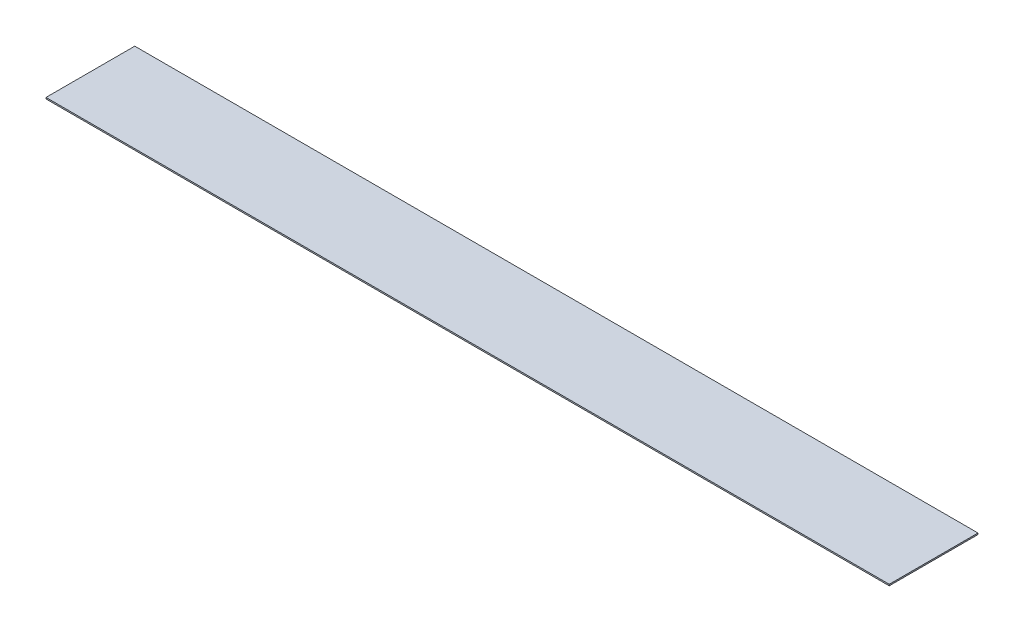
ISO-10303-21;
HEADER;
FILE_DESCRIPTION(('STEP AP214'),'2;1');
FILE_NAME('part.step','',(''),(''),'','','');
FILE_SCHEMA(('AUTOMOTIVE_DESIGN { 1 0 10303 214 1 1 1 1 }'));
ENDSEC;
DATA;
#1=APPLICATION_CONTEXT('core data for automotive mechanical design processes');
#2=APPLICATION_PROTOCOL_DEFINITION('international standard','automotive_design',2000,#1);
#3=PRODUCT_CONTEXT('',#1,'mechanical');
#4=PRODUCT('Part','Part','',(#3));
#5=PRODUCT_RELATED_PRODUCT_CATEGORY('part','',(#4));
#6=PRODUCT_DEFINITION_FORMATION('','',#4);
#7=PRODUCT_DEFINITION_CONTEXT('part definition',#1,'design');
#8=PRODUCT_DEFINITION('design','',#6,#7);
#9=PRODUCT_DEFINITION_SHAPE('','',#8);
#10=(LENGTH_UNIT() NAMED_UNIT(*) SI_UNIT(.MILLI.,.METRE.));
#11=(NAMED_UNIT(*) PLANE_ANGLE_UNIT() SI_UNIT($,.RADIAN.));
#12=(NAMED_UNIT(*) SI_UNIT($,.STERADIAN.) SOLID_ANGLE_UNIT());
#13=UNCERTAINTY_MEASURE_WITH_UNIT(LENGTH_MEASURE(1.E-05),#10,'distance_accuracy_value','');
#14=(GEOMETRIC_REPRESENTATION_CONTEXT(3) GLOBAL_UNCERTAINTY_ASSIGNED_CONTEXT((#13)) GLOBAL_UNIT_ASSIGNED_CONTEXT((#10,
#11,#12)) REPRESENTATION_CONTEXT('',''));
#15=CARTESIAN_POINT('',(0.,0.,0.));
#16=DIRECTION('',(0.,0.,1.));
#17=DIRECTION('',(1.,0.,0.));
#18=AXIS2_PLACEMENT_3D('',#15,#16,#17);
#19=CARTESIAN_POINT('',(0.,1.5875,0.));
#20=DIRECTION('',(1.,0.,0.));
#21=DIRECTION('',(0.,0.,-1.));
#22=AXIS2_PLACEMENT_3D('',#19,#20,#21);
#23=PLANE('',#22);
#24=DIRECTION('',(0.,0.,1.));
#25=VECTOR('',#24,1.);
#26=CARTESIAN_POINT('',(0.,0.,0.));
#27=LINE('',#26,#25);
#28=CARTESIAN_POINT('',(0.,0.,-101.6));
#29=VERTEX_POINT('',#28);
#30=CARTESIAN_POINT('',(0.,0.,0.));
#31=VERTEX_POINT('',#30);
#32=EDGE_CURVE('E97',#29,#31,#27,.T.);
#33=ORIENTED_EDGE('',*,*,#32,.T.);
#34=DIRECTION('',(0.,-1.,0.));
#35=VECTOR('',#34,1.);
#36=CARTESIAN_POINT('',(0.,1.5875,0.));
#37=LINE('',#36,#35);
#38=CARTESIAN_POINT('',(0.,1.5875,0.));
#39=VERTEX_POINT('',#38);
#40=EDGE_CURVE('E11',#39,#31,#37,.T.);
#41=ORIENTED_EDGE('',*,*,#40,.F.);
#42=DIRECTION('',(0.,0.,1.));
#43=VECTOR('',#42,1.);
#44=CARTESIAN_POINT('',(0.,1.5875,0.));
#45=LINE('',#44,#43);
#46=CARTESIAN_POINT('',(0.,1.5875,-101.6));
#47=VERTEX_POINT('',#46);
#48=EDGE_CURVE('E85',#47,#39,#45,.T.);
#49=ORIENTED_EDGE('',*,*,#48,.F.);
#50=DIRECTION('',(0.,-1.,0.));
#51=VECTOR('',#50,1.);
#52=CARTESIAN_POINT('',(0.,1.5875,-101.6));
#53=LINE('',#52,#51);
#54=EDGE_CURVE('E93',#47,#29,#53,.T.);
#55=ORIENTED_EDGE('',*,*,#54,.T.);
#56=EDGE_LOOP('',(#33,#41,#49,#55));
#57=FACE_BOUND('',#56,.T.);
#58=ADVANCED_FACE('F34',(#57),#23,.F.);
#59=CARTESIAN_POINT('',(0.,1.5875,0.));
#60=DIRECTION('',(0.,0.,-1.));
#61=DIRECTION('',(-1.,0.,0.));
#62=AXIS2_PLACEMENT_3D('',#59,#60,#61);
#63=PLANE('',#62);
#64=DIRECTION('',(1.,0.,0.));
#65=VECTOR('',#64,1.);
#66=CARTESIAN_POINT('',(0.,0.,0.));
#67=LINE('',#66,#65);
#68=CARTESIAN_POINT('',(965.2,0.,0.));
#69=VERTEX_POINT('',#68);
#70=EDGE_CURVE('E89',#31,#69,#67,.T.);
#71=ORIENTED_EDGE('',*,*,#70,.T.);
#72=DIRECTION('',(0.,-1.,0.));
#73=VECTOR('',#72,1.);
#74=CARTESIAN_POINT('',(965.2,1.5875,0.));
#75=LINE('',#74,#73);
#76=CARTESIAN_POINT('',(965.2,1.5875,0.));
#77=VERTEX_POINT('',#76);
#78=EDGE_CURVE('E42',#77,#69,#75,.T.);
#79=ORIENTED_EDGE('',*,*,#78,.F.);
#80=DIRECTION('',(1.,0.,0.));
#81=VECTOR('',#80,1.);
#82=CARTESIAN_POINT('',(0.,1.5875,0.));
#83=LINE('',#82,#81);
#84=EDGE_CURVE('E80',#39,#77,#83,.T.);
#85=ORIENTED_EDGE('',*,*,#84,.F.);
#86=ORIENTED_EDGE('',*,*,#40,.T.);
#87=EDGE_LOOP('',(#71,#79,#85,#86));
#88=FACE_BOUND('',#87,.T.);
#89=ADVANCED_FACE('F88',(#88),#63,.F.);
#90=CARTESIAN_POINT('',(965.2,1.5875,0.));
#91=DIRECTION('',(-1.,0.,0.));
#92=DIRECTION('',(0.,0.,1.));
#93=AXIS2_PLACEMENT_3D('',#90,#91,#92);
#94=PLANE('',#93);
#95=DIRECTION('',(0.,0.,-1.));
#96=VECTOR('',#95,1.);
#97=CARTESIAN_POINT('',(965.2,0.,0.));
#98=LINE('',#97,#96);
#99=CARTESIAN_POINT('',(965.2,0.,-101.6));
#100=VERTEX_POINT('',#99);
#101=EDGE_CURVE('E67',#69,#100,#98,.T.);
#102=ORIENTED_EDGE('',*,*,#101,.T.);
#103=DIRECTION('',(0.,-1.,0.));
#104=VECTOR('',#103,1.);
#105=CARTESIAN_POINT('',(965.2,1.5875,-101.6));
#106=LINE('',#105,#104);
#107=CARTESIAN_POINT('',(965.2,1.5875,-101.6));
#108=VERTEX_POINT('',#107);
#109=EDGE_CURVE('E90',#108,#100,#106,.T.);
#110=ORIENTED_EDGE('',*,*,#109,.F.);
#111=DIRECTION('',(0.,0.,-1.));
#112=VECTOR('',#111,1.);
#113=CARTESIAN_POINT('',(965.2,1.5875,0.));
#114=LINE('',#113,#112);
#115=EDGE_CURVE('E83',#77,#108,#114,.T.);
#116=ORIENTED_EDGE('',*,*,#115,.F.);
#117=ORIENTED_EDGE('',*,*,#78,.T.);
#118=EDGE_LOOP('',(#102,#110,#116,#117));
#119=FACE_BOUND('',#118,.T.);
#120=ADVANCED_FACE('F91',(#119),#94,.F.);
#121=CARTESIAN_POINT('',(0.,1.5875,-101.6));
#122=DIRECTION('',(0.,0.,1.));
#123=DIRECTION('',(1.,0.,0.));
#124=AXIS2_PLACEMENT_3D('',#121,#122,#123);
#125=PLANE('',#124);
#126=DIRECTION('',(-1.,0.,0.));
#127=VECTOR('',#126,1.);
#128=CARTESIAN_POINT('',(0.,0.,-101.6));
#129=LINE('',#128,#127);
#130=EDGE_CURVE('E73',#100,#29,#129,.T.);
#131=ORIENTED_EDGE('',*,*,#130,.T.);
#132=ORIENTED_EDGE('',*,*,#54,.F.);
#133=DIRECTION('',(-1.,0.,0.));
#134=VECTOR('',#133,1.);
#135=CARTESIAN_POINT('',(0.,1.5875,-101.6));
#136=LINE('',#135,#134);
#137=EDGE_CURVE('E50',#108,#47,#136,.T.);
#138=ORIENTED_EDGE('',*,*,#137,.F.);
#139=ORIENTED_EDGE('',*,*,#109,.T.);
#140=EDGE_LOOP('',(#131,#132,#138,#139));
#141=FACE_BOUND('',#140,.T.);
#142=ADVANCED_FACE('F104',(#141),#125,.F.);
#143=CARTESIAN_POINT('',(0.,1.5875,0.));
#144=DIRECTION('',(0.,-1.,0.));
#145=DIRECTION('',(0.,0.,-1.));
#146=AXIS2_PLACEMENT_3D('',#143,#144,#145);
#147=PLANE('',#146);
#148=ORIENTED_EDGE('',*,*,#48,.T.);
#149=ORIENTED_EDGE('',*,*,#84,.T.);
#150=ORIENTED_EDGE('',*,*,#115,.T.);
#151=ORIENTED_EDGE('',*,*,#137,.T.);
#152=EDGE_LOOP('',(#148,#149,#150,#151));
#153=FACE_BOUND('',#152,.T.);
#154=ADVANCED_FACE('F81',(#153),#147,.F.);
#155=CARTESIAN_POINT('',(0.,0.,0.));
#156=DIRECTION('',(0.,-1.,0.));
#157=DIRECTION('',(0.,0.,-1.));
#158=AXIS2_PLACEMENT_3D('',#155,#156,#157);
#159=PLANE('',#158);
#160=ORIENTED_EDGE('',*,*,#32,.F.);
#161=ORIENTED_EDGE('',*,*,#130,.F.);
#162=ORIENTED_EDGE('',*,*,#101,.F.);
#163=ORIENTED_EDGE('',*,*,#70,.F.);
#164=EDGE_LOOP('',(#160,#161,#162,#163));
#165=FACE_BOUND('',#164,.T.);
#166=ADVANCED_FACE('F107',(#165),#159,.T.);
#167=CLOSED_SHELL('',(#58,#89,#120,#142,#154,#166));
#168=MANIFOLD_SOLID_BREP('B2',#167);
#169=ADVANCED_BREP_SHAPE_REPRESENTATION('',(#18,#168),#14);
#170=SHAPE_DEFINITION_REPRESENTATION(#9,#169);
ENDSEC;
END-ISO-10303-21;
